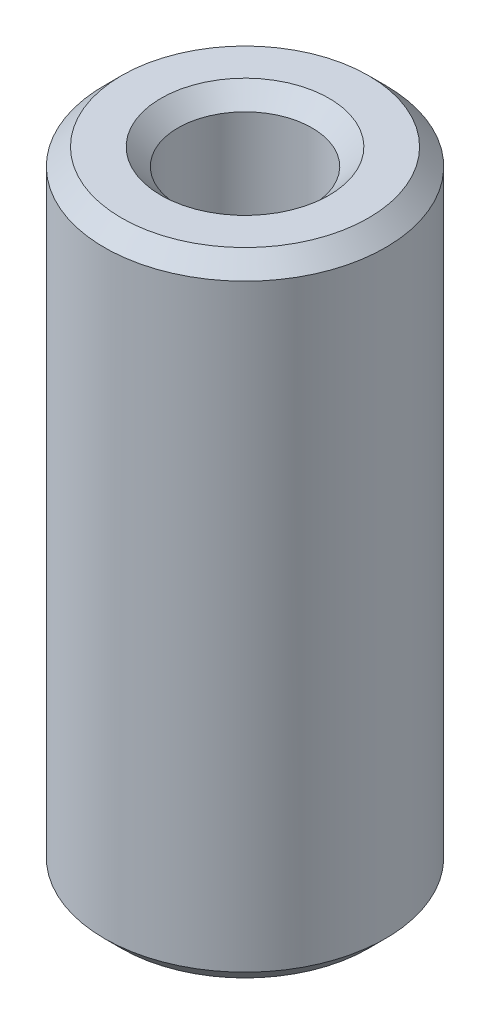
ISO-10303-21;
HEADER;
FILE_DESCRIPTION(('STEP AP214'),'2;1');
FILE_NAME('part.step','',(''),(''),'','','');
FILE_SCHEMA(('AUTOMOTIVE_DESIGN { 1 0 10303 214 1 1 1 1 }'));
ENDSEC;
DATA;
#1=APPLICATION_CONTEXT('core data for automotive mechanical design processes');
#2=APPLICATION_PROTOCOL_DEFINITION('international standard','automotive_design',2000,#1);
#3=PRODUCT_CONTEXT('',#1,'mechanical');
#4=PRODUCT('Part','Part','',(#3));
#5=PRODUCT_RELATED_PRODUCT_CATEGORY('part','',(#4));
#6=PRODUCT_DEFINITION_FORMATION('','',#4);
#7=PRODUCT_DEFINITION_CONTEXT('part definition',#1,'design');
#8=PRODUCT_DEFINITION('design','',#6,#7);
#9=PRODUCT_DEFINITION_SHAPE('','',#8);
#10=(LENGTH_UNIT() NAMED_UNIT(*) SI_UNIT(.MILLI.,.METRE.));
#11=(NAMED_UNIT(*) PLANE_ANGLE_UNIT() SI_UNIT($,.RADIAN.));
#12=(NAMED_UNIT(*) SI_UNIT($,.STERADIAN.) SOLID_ANGLE_UNIT());
#13=UNCERTAINTY_MEASURE_WITH_UNIT(LENGTH_MEASURE(1.E-05),#10,'distance_accuracy_value','');
#14=(GEOMETRIC_REPRESENTATION_CONTEXT(3) GLOBAL_UNCERTAINTY_ASSIGNED_CONTEXT((#13)) GLOBAL_UNIT_ASSIGNED_CONTEXT((#10,
#11,#12)) REPRESENTATION_CONTEXT('',''));
#15=CARTESIAN_POINT('',(0.,0.,0.));
#16=DIRECTION('',(0.,0.,1.));
#17=DIRECTION('',(1.,0.,0.));
#18=AXIS2_PLACEMENT_3D('',#15,#16,#17);
#19=CARTESIAN_POINT('',(0.,33.7642883035466,0.));
#20=DIRECTION('',(0.,-1.,0.));
#21=DIRECTION('',(0.,0.,-1.));
#22=AXIS2_PLACEMENT_3D('',#19,#20,#21);
#23=CYLINDRICAL_SURFACE('',#22,7.5);
#24=CARTESIAN_POINT('',(0.,0.911260135302329,0.));
#25=DIRECTION('',(0.,1.,0.));
#26=DIRECTION('',(0.,0.,1.));
#27=AXIS2_PLACEMENT_3D('',#24,#25,#26);
#28=CIRCLE('',#27,7.5);
#29=CARTESIAN_POINT('',(0.,0.911260135302329,7.5));
#30=VERTEX_POINT('',#29);
#31=EDGE_CURVE('E10',#30,#30,#28,.T.);
#32=ORIENTED_EDGE('',*,*,#31,.T.);
#33=EDGE_LOOP('',(#32));
#34=FACE_BOUND('',#33,.T.);
#35=CARTESIAN_POINT('',(0.,32.8530281682443,0.));
#36=DIRECTION('',(0.,1.,0.));
#37=DIRECTION('',(0.,0.,1.));
#38=AXIS2_PLACEMENT_3D('',#35,#36,#37);
#39=CIRCLE('',#38,7.5);
#40=CARTESIAN_POINT('',(0.,32.8530281682443,-7.5));
#41=VERTEX_POINT('',#40);
#42=EDGE_CURVE('E50',#41,#41,#39,.F.);
#43=ORIENTED_EDGE('',*,*,#42,.T.);
#44=EDGE_LOOP('',(#43));
#45=FACE_BOUND('',#44,.T.);
#46=ADVANCED_FACE('F39',(#34,#45),#23,.T.);
#47=CARTESIAN_POINT('',(0.,33.7642883035466,0.));
#48=DIRECTION('',(0.,1.,0.));
#49=DIRECTION('',(0.,0.,1.));
#50=AXIS2_PLACEMENT_3D('',#47,#48,#49);
#51=PLANE('',#50);
#52=CARTESIAN_POINT('',(0.,33.7642883035466,0.));
#53=DIRECTION('',(0.,1.,0.));
#54=DIRECTION('',(0.,0.,1.));
#55=AXIS2_PLACEMENT_3D('',#52,#53,#54);
#56=CIRCLE('',#55,4.48749144929484);
#57=CARTESIAN_POINT('',(0.,33.7642883035466,4.48749144929484));
#58=VERTEX_POINT('',#57);
#59=EDGE_CURVE('E58',#58,#58,#56,.F.);
#60=ORIENTED_EDGE('',*,*,#59,.T.);
#61=EDGE_LOOP('',(#60));
#62=FACE_BOUND('',#61,.T.);
#63=CARTESIAN_POINT('',(0.,33.7642883035466,0.));
#64=DIRECTION('',(0.,1.,0.));
#65=DIRECTION('',(0.,0.,1.));
#66=AXIS2_PLACEMENT_3D('',#63,#64,#65);
#67=CIRCLE('',#66,6.58873986469768);
#68=CARTESIAN_POINT('',(0.,33.7642883035466,-6.58873986469768));
#69=VERTEX_POINT('',#68);
#70=EDGE_CURVE('E61',#69,#69,#67,.T.);
#71=ORIENTED_EDGE('',*,*,#70,.T.);
#72=EDGE_LOOP('',(#71));
#73=FACE_BOUND('',#72,.T.);
#74=ADVANCED_FACE('F88',(#62,#73),#51,.T.);
#75=CARTESIAN_POINT('',(0.,0.,0.));
#76=DIRECTION('',(0.,1.,0.));
#77=DIRECTION('',(0.,0.,1.));
#78=AXIS2_PLACEMENT_3D('',#75,#76,#77);
#79=PLANE('',#78);
#80=CARTESIAN_POINT('',(0.,0.,0.));
#81=DIRECTION('',(0.,1.,0.));
#82=DIRECTION('',(0.,0.,1.));
#83=AXIS2_PLACEMENT_3D('',#80,#81,#82);
#84=CIRCLE('',#83,4.48749144929485);
#85=CARTESIAN_POINT('',(0.,0.,4.48749144929485));
#86=VERTEX_POINT('',#85);
#87=EDGE_CURVE('E51',#86,#86,#84,.T.);
#88=ORIENTED_EDGE('',*,*,#87,.T.);
#89=EDGE_LOOP('',(#88));
#90=FACE_BOUND('',#89,.T.);
#91=CARTESIAN_POINT('',(0.,0.,0.));
#92=DIRECTION('',(0.,1.,0.));
#93=DIRECTION('',(0.,0.,1.));
#94=AXIS2_PLACEMENT_3D('',#91,#92,#93);
#95=CIRCLE('',#94,6.58873986469766);
#96=CARTESIAN_POINT('',(0.,0.,6.58873986469766));
#97=VERTEX_POINT('',#96);
#98=EDGE_CURVE('E54',#97,#97,#95,.F.);
#99=ORIENTED_EDGE('',*,*,#98,.T.);
#100=EDGE_LOOP('',(#99));
#101=FACE_BOUND('',#100,.T.);
#102=ADVANCED_FACE('F83',(#90,#101),#79,.F.);
#103=CARTESIAN_POINT('',(0.,33.7642883035466,0.));
#104=DIRECTION('',(0.,-1.,0.));
#105=DIRECTION('',(0.,0.,-1.));
#106=AXIS2_PLACEMENT_3D('',#103,#104,#105);
#107=CYLINDRICAL_SURFACE('',#106,3.57623131399252);
#108=CARTESIAN_POINT('',(0.,32.8530281682443,0.));
#109=DIRECTION('',(0.,1.,0.));
#110=DIRECTION('',(0.,0.,1.));
#111=AXIS2_PLACEMENT_3D('',#108,#109,#110);
#112=CIRCLE('',#111,3.57623131399252);
#113=CARTESIAN_POINT('',(0.,32.8530281682443,3.57623131399252));
#114=VERTEX_POINT('',#113);
#115=EDGE_CURVE('E67',#114,#114,#112,.T.);
#116=ORIENTED_EDGE('',*,*,#115,.T.);
#117=EDGE_LOOP('',(#116));
#118=FACE_BOUND('',#117,.T.);
#119=CARTESIAN_POINT('',(0.,0.911260135302329,0.));
#120=DIRECTION('',(0.,1.,0.));
#121=DIRECTION('',(0.,0.,1.));
#122=AXIS2_PLACEMENT_3D('',#119,#120,#121);
#123=CIRCLE('',#122,3.57623131399252);
#124=CARTESIAN_POINT('',(0.,0.911260135302329,3.57623131399252));
#125=VERTEX_POINT('',#124);
#126=EDGE_CURVE('E69',#125,#125,#123,.F.);
#127=ORIENTED_EDGE('',*,*,#126,.T.);
#128=EDGE_LOOP('',(#127));
#129=FACE_BOUND('',#128,.T.);
#130=ADVANCED_FACE('F71',(#118,#129),#107,.F.);
#131=CARTESIAN_POINT('',(0.,32.8530281682443,0.));
#132=DIRECTION('',(0.,1.,0.));
#133=DIRECTION('',(0.,0.,1.));
#134=AXIS2_PLACEMENT_3D('',#131,#132,#133);
#135=CONICAL_SURFACE('',#134,3.57623131399252,0.785398163397448);
#136=CARTESIAN_POINT('',(0.,33.7642883035466,4.48749144929484));
#137=CARTESIAN_POINT('',(0.,33.7547960104706,4.47799915621877));
#138=CARTESIAN_POINT('',(0.,33.7453037173945,4.46850686314271));
#139=CARTESIAN_POINT('',(0.,33.7263191312424,4.44952227699058));
#140=CARTESIAN_POINT('',(0.,33.7168268381663,4.44002998391451));
#141=CARTESIAN_POINT('',(0.,33.6978422520142,4.42104539776238));
#142=CARTESIAN_POINT('',(0.,33.6883499589381,4.41155310468631));
#143=CARTESIAN_POINT('',(0.,33.669365372786,4.39256851853418));
#144=CARTESIAN_POINT('',(0.,33.6598730797099,4.38307622545812));
#145=CARTESIAN_POINT('',(0.,33.6408884935578,4.36409163930598));
#146=CARTESIAN_POINT('',(0.,33.6313962004817,4.35459934622992));
#147=CARTESIAN_POINT('',(0.,33.6124116143296,4.33561476007779));
#148=CARTESIAN_POINT('',(0.,33.6029193212535,4.32612246700172));
#149=CARTESIAN_POINT('',(0.,33.5839347351014,4.30713788084959));
#150=CARTESIAN_POINT('',(0.,33.5744424420253,4.29764558777352));
#151=CARTESIAN_POINT('',(0.,33.5554578558732,4.27866100162139));
#152=CARTESIAN_POINT('',(0.,33.5459655627971,4.26916870854533));
#153=CARTESIAN_POINT('',(0.,33.526980976645,4.2501841223932));
#154=CARTESIAN_POINT('',(0.,33.5174886835689,4.24069182931713));
#155=CARTESIAN_POINT('',(0.,33.4985040974168,4.221707243165));
#156=CARTESIAN_POINT('',(0.,33.4890118043407,4.21221495008893));
#157=CARTESIAN_POINT('',(0.,33.4700272181886,4.1932303639368));
#158=CARTESIAN_POINT('',(0.,33.4605349251125,4.18373807086073));
#159=CARTESIAN_POINT('',(0.,33.4415503389604,4.1647534847086));
#160=CARTESIAN_POINT('',(0.,33.4320580458843,4.15526119163254));
#161=CARTESIAN_POINT('',(0.,33.4130734597322,4.1362766054804));
#162=CARTESIAN_POINT('',(0.,33.4035811666561,4.12678431240434));
#163=CARTESIAN_POINT('',(0.,33.384596580504,4.10779972625221));
#164=CARTESIAN_POINT('',(0.,33.3751042874279,4.09830743317614));
#165=CARTESIAN_POINT('',(0.,33.3561197012758,4.07932284702401));
#166=CARTESIAN_POINT('',(0.,33.3466274081998,4.06983055394794));
#167=CARTESIAN_POINT('',(0.,33.3276428220476,4.05084596779581));
#168=CARTESIAN_POINT('',(0.,33.3181505289716,4.04135367471975));
#169=CARTESIAN_POINT('',(0.,33.2991659428194,4.02236908856762));
#170=CARTESIAN_POINT('',(0.,33.2896736497433,4.01287679549155));
#171=CARTESIAN_POINT('',(0.,33.2706890635912,3.99389220933942));
#172=CARTESIAN_POINT('',(0.,33.2611967705151,3.98439991626335));
#173=CARTESIAN_POINT('',(0.,33.242212184363,3.96541533011122));
#174=CARTESIAN_POINT('',(0.,33.232719891287,3.95592303703515));
#175=CARTESIAN_POINT('',(0.,33.2137353051348,3.93693845088302));
#176=CARTESIAN_POINT('',(0.,33.2042430120588,3.92744615780696));
#177=CARTESIAN_POINT('',(0.,33.1852584259066,3.90846157165482));
#178=CARTESIAN_POINT('',(0.,33.1757661328306,3.89896927857876));
#179=CARTESIAN_POINT('',(0.,33.1567815466784,3.87998469242663));
#180=CARTESIAN_POINT('',(0.,33.1472892536024,3.87049239935056));
#181=CARTESIAN_POINT('',(0.,33.1283046674502,3.85150781319843));
#182=CARTESIAN_POINT('',(0.,33.1188123743742,3.84201552012236));
#183=CARTESIAN_POINT('',(0.,33.099827788222,3.82303093397023));
#184=CARTESIAN_POINT('',(0.,33.090335495146,3.81353864089417));
#185=CARTESIAN_POINT('',(0.,33.0713509089938,3.79455405474204));
#186=CARTESIAN_POINT('',(0.,33.0618586159178,3.78506176166597));
#187=CARTESIAN_POINT('',(0.,33.0428740297656,3.76607717551384));
#188=CARTESIAN_POINT('',(0.,33.0333817366896,3.75658488243777));
#189=CARTESIAN_POINT('',(0.,33.0143971505374,3.73760029628564));
#190=CARTESIAN_POINT('',(0.,33.0049048574614,3.72810800320957));
#191=CARTESIAN_POINT('',(0.,32.9859202713092,3.70912341705744));
#192=CARTESIAN_POINT('',(0.,32.9764279782332,3.69963112398138));
#193=CARTESIAN_POINT('',(0.,32.9574433920811,3.68064653782924));
#194=CARTESIAN_POINT('',(0.,32.947951099005,3.67115424475318));
#195=CARTESIAN_POINT('',(0.,32.9289665128529,3.65216965860105));
#196=CARTESIAN_POINT('',(0.,32.9194742197768,3.64267736552498));
#197=CARTESIAN_POINT('',(0.,32.9004896336247,3.62369277937285));
#198=CARTESIAN_POINT('',(0.,32.8909973405486,3.61420048629678));
#199=CARTESIAN_POINT('',(0.,32.8720127543965,3.59521590014465));
#200=CARTESIAN_POINT('',(0.,32.8625204613204,3.58572360706859));
#201=CARTESIAN_POINT('',(0.,32.8530281682443,3.57623131399252));
#202=B_SPLINE_CURVE_WITH_KNOTS('',3,(#136,#137,#138,#139,#140,#141,#142,#143,#144,#145,#146,
#147,#148,#149,#150,#151,#152,#153,#154,#155,#156,#157,#158,#159,#160,#161,#162,#163,#164,#165,
#166,#167,#168,#169,#170,#171,#172,#173,#174,#175,#176,#177,#178,#179,#180,#181,#182,#183,#184,
#185,#186,#187,#188,#189,#190,#191,#192,#193,#194,#195,#196,#197,#198,#199,#200,#201),
.UNSPECIFIED.,.F.,.F.,(4,2,2,2,2,2,2,2,2,2,2,2,2,2,2,2,2,2,2,2,2,2,2,2,2,2,2,2,2,2,2,2,4),(0.,
0.0402723888185771,0.0805447776371541,0.120817166455731,0.161089555274308,0.201361944092885,
0.241634332911462,0.281906721730039,0.322179110548621,0.362451499367198,0.402723888185775,
0.442996277004352,0.48326866582293,0.523541054641506,0.563813443460083,0.60408583227866,
0.644358221097242,0.684630609915819,0.724902998734396,0.765175387552974,0.805447776371551,
0.845720165190128,0.885992554008705,0.926264942827282,0.966537331645864,1.00680972046444,
1.04708210928302,1.0873544981016,1.12762688692017,1.16789927573875,1.20817166455733,
1.2484440533759,1.28871644219448),.UNSPECIFIED.);
#203=EDGE_CURVE('BSEAM77',#58,#114,#202,.T.);
#204=ORIENTED_EDGE('',*,*,#59,.F.);
#205=ORIENTED_EDGE('',*,*,#115,.F.);
#206=ORIENTED_EDGE('',*,*,#203,.T.);
#207=ORIENTED_EDGE('',*,*,#203,.F.);
#208=EDGE_LOOP('',(#204,#206,#205,#207));
#209=FACE_BOUND('',#208,.T.);
#210=ADVANCED_FACE('F77',(#209),#135,.F.);
#211=CARTESIAN_POINT('',(0.,0.,0.));
#212=DIRECTION('',(0.,-1.,0.));
#213=DIRECTION('',(0.,0.,-1.));
#214=AXIS2_PLACEMENT_3D('',#211,#212,#213);
#215=CONICAL_SURFACE('',#214,4.48749144929485,0.785398163397448);
#216=ORIENTED_EDGE('',*,*,#126,.F.);
#217=EDGE_LOOP('',(#216));
#218=FACE_BOUND('',#217,.T.);
#219=ORIENTED_EDGE('',*,*,#87,.F.);
#220=EDGE_LOOP('',(#219));
#221=FACE_BOUND('',#220,.T.);
#222=ADVANCED_FACE('F73',(#218,#221),#215,.F.);
#223=CARTESIAN_POINT('',(0.,0.911260135302329,0.));
#224=DIRECTION('',(0.,1.,0.));
#225=DIRECTION('',(0.,0.,1.));
#226=AXIS2_PLACEMENT_3D('',#223,#224,#225);
#227=CONICAL_SURFACE('',#226,7.5,0.785398163397452);
#228=ORIENTED_EDGE('',*,*,#98,.F.);
#229=EDGE_LOOP('',(#228));
#230=FACE_BOUND('',#229,.T.);
#231=ORIENTED_EDGE('',*,*,#31,.F.);
#232=EDGE_LOOP('',(#231));
#233=FACE_BOUND('',#232,.T.);
#234=ADVANCED_FACE('F76',(#230,#233),#227,.T.);
#235=CARTESIAN_POINT('',(0.,33.7642883035466,0.));
#236=DIRECTION('',(0.,-1.,0.));
#237=DIRECTION('',(0.,0.,-1.));
#238=AXIS2_PLACEMENT_3D('',#235,#236,#237);
#239=CONICAL_SURFACE('',#238,6.58873986469768,0.785398163397446);
#240=CARTESIAN_POINT('',(0.,32.8530281682443,-7.5));
#241=CARTESIAN_POINT('',(0.,32.8625204613204,-7.49050770692394));
#242=CARTESIAN_POINT('',(0.,32.8720127543965,-7.48101541384787));
#243=CARTESIAN_POINT('',(0.,32.8909973405486,-7.46203082769574));
#244=CARTESIAN_POINT('',(0.,32.9004896336247,-7.45253853461967));
#245=CARTESIAN_POINT('',(0.,32.9194742197768,-7.43355394846754));
#246=CARTESIAN_POINT('',(0.,32.9289665128529,-7.42406165539148));
#247=CARTESIAN_POINT('',(0.,32.947951099005,-7.40507706923935));
#248=CARTESIAN_POINT('',(0.,32.9574433920811,-7.39558477616328));
#249=CARTESIAN_POINT('',(0.,32.9764279782332,-7.37660019001115));
#250=CARTESIAN_POINT('',(0.,32.9859202713092,-7.36710789693508));
#251=CARTESIAN_POINT('',(0.,33.0049048574614,-7.34812331078295));
#252=CARTESIAN_POINT('',(0.,33.0143971505374,-7.33863101770688));
#253=CARTESIAN_POINT('',(0.,33.0333817366896,-7.31964643155475));
#254=CARTESIAN_POINT('',(0.,33.0428740297656,-7.31015413847869));
#255=CARTESIAN_POINT('',(0.,33.0618586159178,-7.29116955232656));
#256=CARTESIAN_POINT('',(0.,33.0713509089938,-7.28167725925049));
#257=CARTESIAN_POINT('',(0.,33.090335495146,-7.26269267309836));
#258=CARTESIAN_POINT('',(0.,33.099827788222,-7.25320038002229));
#259=CARTESIAN_POINT('',(0.,33.1188123743742,-7.23421579387016));
#260=CARTESIAN_POINT('',(0.,33.1283046674502,-7.2247235007941));
#261=CARTESIAN_POINT('',(0.,33.1472892536024,-7.20573891464196));
#262=CARTESIAN_POINT('',(0.,33.1567815466784,-7.1962466215659));
#263=CARTESIAN_POINT('',(0.,33.1757661328306,-7.17726203541377));
#264=CARTESIAN_POINT('',(0.,33.1852584259066,-7.1677697423377));
#265=CARTESIAN_POINT('',(0.,33.2042430120588,-7.14878515618557));
#266=CARTESIAN_POINT('',(0.,33.2137353051348,-7.1392928631095));
#267=CARTESIAN_POINT('',(0.,33.232719891287,-7.12030827695737));
#268=CARTESIAN_POINT('',(0.,33.242212184363,-7.1108159838813));
#269=CARTESIAN_POINT('',(0.,33.2611967705151,-7.09183139772917));
#270=CARTESIAN_POINT('',(0.,33.2706890635912,-7.08233910465311));
#271=CARTESIAN_POINT('',(0.,33.2896736497433,-7.06335451850098));
#272=CARTESIAN_POINT('',(0.,33.2991659428194,-7.05386222542491));
#273=CARTESIAN_POINT('',(0.,33.3181505289716,-7.03487763927278));
#274=CARTESIAN_POINT('',(0.,33.3276428220476,-7.02538534619671));
#275=CARTESIAN_POINT('',(0.,33.3466274081998,-7.00640076004458));
#276=CARTESIAN_POINT('',(0.,33.3561197012758,-6.99690846696851));
#277=CARTESIAN_POINT('',(0.,33.3751042874279,-6.97792388081638));
#278=CARTESIAN_POINT('',(0.,33.384596580504,-6.96843158774032));
#279=CARTESIAN_POINT('',(0.,33.4035811666561,-6.94944700158819));
#280=CARTESIAN_POINT('',(0.,33.4130734597322,-6.93995470851212));
#281=CARTESIAN_POINT('',(0.,33.4320580458843,-6.92097012235999));
#282=CARTESIAN_POINT('',(0.,33.4415503389604,-6.91147782928392));
#283=CARTESIAN_POINT('',(0.,33.4605349251125,-6.89249324313179));
#284=CARTESIAN_POINT('',(0.,33.4700272181886,-6.88300095005573));
#285=CARTESIAN_POINT('',(0.,33.4890118043407,-6.86401636390359));
#286=CARTESIAN_POINT('',(0.,33.4985040974168,-6.85452407082753));
#287=CARTESIAN_POINT('',(0.,33.5174886835689,-6.8355394846754));
#288=CARTESIAN_POINT('',(0.,33.526980976645,-6.82604719159933));
#289=CARTESIAN_POINT('',(0.,33.5459655627971,-6.8070626054472));
#290=CARTESIAN_POINT('',(0.,33.5554578558732,-6.79757031237113));
#291=CARTESIAN_POINT('',(0.,33.5744424420253,-6.778585726219));
#292=CARTESIAN_POINT('',(0.,33.5839347351014,-6.76909343314293));
#293=CARTESIAN_POINT('',(0.,33.6029193212535,-6.7501088469908));
#294=CARTESIAN_POINT('',(0.,33.6124116143296,-6.74061655391474));
#295=CARTESIAN_POINT('',(0.,33.6313962004817,-6.72163196776261));
#296=CARTESIAN_POINT('',(0.,33.6408884935578,-6.71213967468654));
#297=CARTESIAN_POINT('',(0.,33.6598730797099,-6.69315508853441));
#298=CARTESIAN_POINT('',(0.,33.669365372786,-6.68366279545834));
#299=CARTESIAN_POINT('',(0.,33.6883499589381,-6.66467820930621));
#300=CARTESIAN_POINT('',(0.,33.6978422520142,-6.65518591623015));
#301=CARTESIAN_POINT('',(0.,33.7168268381663,-6.63620133007801));
#302=CARTESIAN_POINT('',(0.,33.7263191312424,-6.62670903700195));
#303=CARTESIAN_POINT('',(0.,33.7453037173945,-6.60772445084982));
#304=CARTESIAN_POINT('',(0.,33.7547960104706,-6.59823215777375));
#305=CARTESIAN_POINT('',(0.,33.7642883035466,-6.58873986469768));
#306=B_SPLINE_CURVE_WITH_KNOTS('',3,(#240,#241,#242,#243,#244,#245,#246,#247,#248,#249,#250,
#251,#252,#253,#254,#255,#256,#257,#258,#259,#260,#261,#262,#263,#264,#265,#266,#267,#268,#269,
#270,#271,#272,#273,#274,#275,#276,#277,#278,#279,#280,#281,#282,#283,#284,#285,#286,#287,#288,
#289,#290,#291,#292,#293,#294,#295,#296,#297,#298,#299,#300,#301,#302,#303,#304,#305),
.UNSPECIFIED.,.F.,.F.,(4,2,2,2,2,2,2,2,2,2,2,2,2,2,2,2,2,2,2,2,2,2,2,2,2,2,2,2,2,2,2,2,4),(0.,
0.040272388818582,0.080544777637159,0.120817166455735,0.161089555274313,0.20136194409289,
0.241634332911467,0.281906721730044,0.322179110548621,0.362451499367203,0.402723888185779,
0.442996277004356,0.483268665822933,0.52354105464151,0.563813443460087,0.604085832278665,
0.644358221097242,0.684630609915824,0.724902998734401,0.765175387552977,0.805447776371554,
0.845720165190131,0.885992554008709,0.926264942827286,0.966537331645868,1.00680972046444,
1.04708210928302,1.0873544981016,1.12762688692017,1.16789927573875,1.20817166455733,
1.24844405337591,1.28871644219449),.UNSPECIFIED.);
#307=EDGE_CURVE('BSEAM45',#41,#69,#306,.T.);
#308=ORIENTED_EDGE('',*,*,#42,.F.);
#309=ORIENTED_EDGE('',*,*,#70,.F.);
#310=ORIENTED_EDGE('',*,*,#307,.T.);
#311=ORIENTED_EDGE('',*,*,#307,.F.);
#312=EDGE_LOOP('',(#308,#310,#309,#311));
#313=FACE_BOUND('',#312,.T.);
#314=ADVANCED_FACE('F45',(#313),#239,.T.);
#315=CLOSED_SHELL('',(#46,#74,#102,#130,#210,#222,#234,#314));
#316=MANIFOLD_SOLID_BREP('B2',#315);
#317=ADVANCED_BREP_SHAPE_REPRESENTATION('',(#18,#316),#14);
#318=SHAPE_DEFINITION_REPRESENTATION(#9,#317);
ENDSEC;
END-ISO-10303-21;
